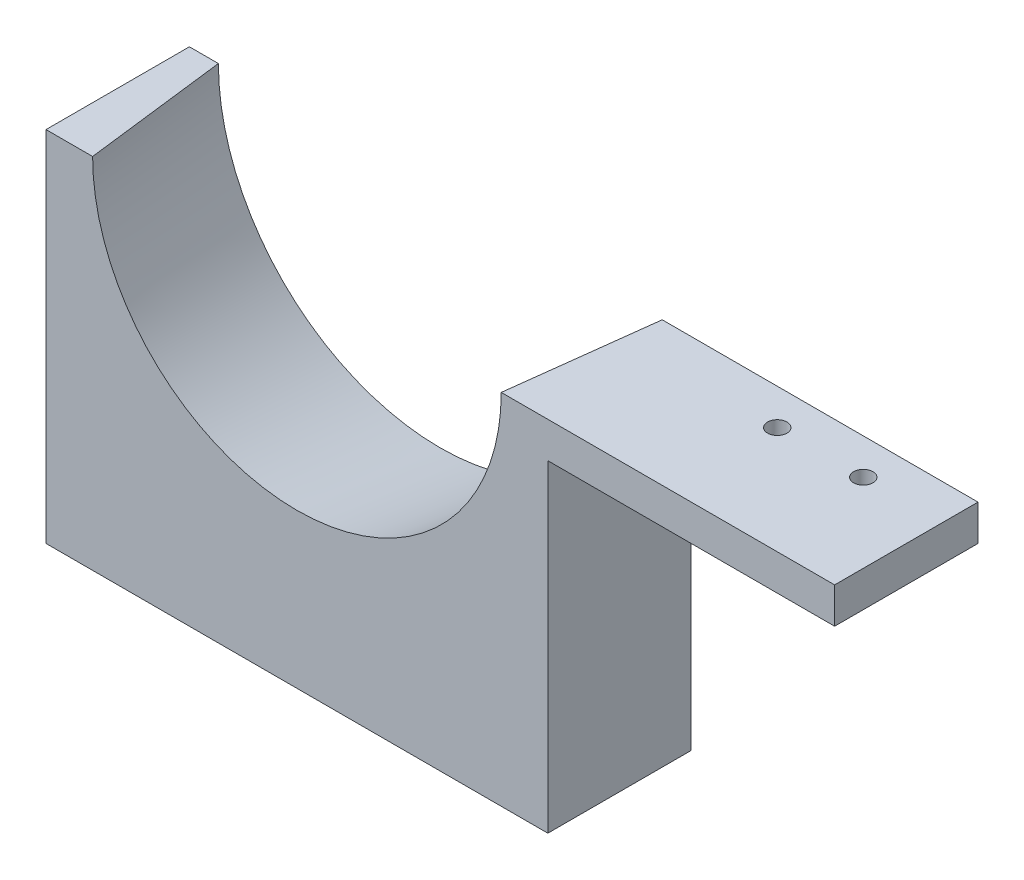
ISO-10303-21;
HEADER;
FILE_DESCRIPTION(('STEP AP214'),'2;1');
FILE_NAME('part.step','',(''),(''),'','','');
FILE_SCHEMA(('AUTOMOTIVE_DESIGN { 1 0 10303 214 1 1 1 1 }'));
ENDSEC;
DATA;
#1=APPLICATION_CONTEXT('core data for automotive mechanical design processes');
#2=APPLICATION_PROTOCOL_DEFINITION('international standard','automotive_design',2000,#1);
#3=PRODUCT_CONTEXT('',#1,'mechanical');
#4=PRODUCT('Part','Part','',(#3));
#5=PRODUCT_RELATED_PRODUCT_CATEGORY('part','',(#4));
#6=PRODUCT_DEFINITION_FORMATION('','',#4);
#7=PRODUCT_DEFINITION_CONTEXT('part definition',#1,'design');
#8=PRODUCT_DEFINITION('design','',#6,#7);
#9=PRODUCT_DEFINITION_SHAPE('','',#8);
#10=(LENGTH_UNIT() NAMED_UNIT(*) SI_UNIT(.MILLI.,.METRE.));
#11=(NAMED_UNIT(*) PLANE_ANGLE_UNIT() SI_UNIT($,.RADIAN.));
#12=(NAMED_UNIT(*) SI_UNIT($,.STERADIAN.) SOLID_ANGLE_UNIT());
#13=UNCERTAINTY_MEASURE_WITH_UNIT(LENGTH_MEASURE(1.E-05),#10,'distance_accuracy_value','');
#14=(GEOMETRIC_REPRESENTATION_CONTEXT(3) GLOBAL_UNCERTAINTY_ASSIGNED_CONTEXT((#13)) GLOBAL_UNIT_ASSIGNED_CONTEXT((#10,
#11,#12)) REPRESENTATION_CONTEXT('',''));
#15=CARTESIAN_POINT('',(0.,0.,0.));
#16=DIRECTION('',(0.,0.,1.));
#17=DIRECTION('',(1.,0.,0.));
#18=AXIS2_PLACEMENT_3D('',#15,#16,#17);
#19=CARTESIAN_POINT('',(0.,0.,20.));
#20=DIRECTION('',(0.,-1.,0.));
#21=DIRECTION('',(1.,0.,0.));
#22=AXIS2_PLACEMENT_3D('',#19,#20,#21);
#23=PLANE('',#22);
#24=DIRECTION('',(-1.,0.,0.));
#25=VECTOR('',#24,1.);
#26=CARTESIAN_POINT('',(0.,0.,20.));
#27=LINE('',#26,#25);
#28=CARTESIAN_POINT('',(-103.5,0.,20.));
#29=VERTEX_POINT('',#28);
#30=CARTESIAN_POINT('',(-110.,0.,20.));
#31=VERTEX_POINT('',#30);
#32=EDGE_CURVE('E96',#29,#31,#27,.T.);
#33=ORIENTED_EDGE('',*,*,#32,.F.);
#34=DIRECTION('',(-0.121869343405148,0.,-0.992546151641322));
#35=VECTOR('',#34,1.);
#36=CARTESIAN_POINT('',(-75.,0.,252.113873197276));
#37=LINE('',#36,#35);
#38=CARTESIAN_POINT('',(-105.955691218058,0.,0.));
#39=VERTEX_POINT('',#38);
#40=EDGE_CURVE('E166',#29,#39,#37,.T.);
#41=ORIENTED_EDGE('',*,*,#40,.T.);
#42=DIRECTION('',(-1.,0.,0.));
#43=VECTOR('',#42,1.);
#44=CARTESIAN_POINT('',(0.,0.,0.));
#45=LINE('',#44,#43);
#46=CARTESIAN_POINT('',(-110.,0.,0.));
#47=VERTEX_POINT('',#46);
#48=EDGE_CURVE('E138',#39,#47,#45,.T.);
#49=ORIENTED_EDGE('',*,*,#48,.T.);
#50=DIRECTION('',(0.,0.,-1.));
#51=VECTOR('',#50,1.);
#52=CARTESIAN_POINT('',(-110.,0.,20.));
#53=LINE('',#52,#51);
#54=EDGE_CURVE('E47',#31,#47,#53,.T.);
#55=ORIENTED_EDGE('',*,*,#54,.F.);
#56=EDGE_LOOP('',(#33,#41,#49,#55));
#57=FACE_BOUND('',#56,.T.);
#58=ADVANCED_FACE('F39',(#57),#23,.F.);
#59=CARTESIAN_POINT('',(-23.0000000000479,0.,4.99999999998709));
#60=DIRECTION('',(0.,-1.,0.));
#61=DIRECTION('',(1.,0.,0.));
#62=AXIS2_PLACEMENT_3D('',#59,#60,#61);
#63=CIRCLE('',#62,1.35000000000145);
#64=CARTESIAN_POINT('',(-21.6500000000464,0.,4.99999999998709));
#65=VERTEX_POINT('',#64);
#66=EDGE_CURVE('E181',#65,#65,#63,.T.);
#67=ORIENTED_EDGE('',*,*,#66,.T.);
#68=EDGE_LOOP('',(#67));
#69=FACE_BOUND('',#68,.T.);
#70=CARTESIAN_POINT('',(-11.0000000000479,0.,4.99999999999137));
#71=DIRECTION('',(0.,-1.,0.));
#72=DIRECTION('',(1.,0.,0.));
#73=AXIS2_PLACEMENT_3D('',#70,#71,#72);
#74=CIRCLE('',#73,1.35000000000145);
#75=CARTESIAN_POINT('',(-9.65000000004644,0.,4.99999999999137));
#76=VERTEX_POINT('',#75);
#77=EDGE_CURVE('E182',#76,#76,#74,.T.);
#78=ORIENTED_EDGE('',*,*,#77,.T.);
#79=EDGE_LOOP('',(#78));
#80=FACE_BOUND('',#79,.T.);
#81=CARTESIAN_POINT('',(0.,0.,0.));
#82=VERTEX_POINT('',#81);
#83=CARTESIAN_POINT('',(-44.0443087819419,0.,0.));
#84=VERTEX_POINT('',#83);
#85=EDGE_CURVE('E135',#82,#84,#45,.T.);
#86=ORIENTED_EDGE('',*,*,#85,.T.);
#87=DIRECTION('',(-0.121869343405148,0.,0.992546151641322));
#88=VECTOR('',#87,1.);
#89=CARTESIAN_POINT('',(-75.,0.,252.113873197276));
#90=LINE('',#89,#88);
#91=CARTESIAN_POINT('',(-46.5,0.,20.));
#92=VERTEX_POINT('',#91);
#93=EDGE_CURVE('E54',#84,#92,#90,.T.);
#94=ORIENTED_EDGE('',*,*,#93,.T.);
#95=CARTESIAN_POINT('',(0.,0.,20.));
#96=VERTEX_POINT('',#95);
#97=EDGE_CURVE('E172',#96,#92,#27,.T.);
#98=ORIENTED_EDGE('',*,*,#97,.F.);
#99=DIRECTION('',(0.,0.,-1.));
#100=VECTOR('',#99,1.);
#101=CARTESIAN_POINT('',(0.,0.,20.));
#102=LINE('',#101,#100);
#103=EDGE_CURVE('E62',#96,#82,#102,.T.);
#104=ORIENTED_EDGE('',*,*,#103,.T.);
#105=EDGE_LOOP('',(#86,#94,#98,#104));
#106=FACE_BOUND('',#105,.T.);
#107=ADVANCED_FACE('F41',(#69,#80,#106),#23,.F.);
#108=CARTESIAN_POINT('',(-110.,0.,20.));
#109=DIRECTION('',(1.,0.,0.));
#110=DIRECTION('',(0.,1.,0.));
#111=AXIS2_PLACEMENT_3D('',#108,#109,#110);
#112=PLANE('',#111);
#113=DIRECTION('',(0.,-1.,0.));
#114=VECTOR('',#113,1.);
#115=CARTESIAN_POINT('',(-110.,0.,0.));
#116=LINE('',#115,#114);
#117=CARTESIAN_POINT('',(-110.,-50.,0.));
#118=VERTEX_POINT('',#117);
#119=EDGE_CURVE('E137',#47,#118,#116,.T.);
#120=ORIENTED_EDGE('',*,*,#119,.T.);
#121=DIRECTION('',(0.,0.,-1.));
#122=VECTOR('',#121,1.);
#123=CARTESIAN_POINT('',(-110.,-50.,20.));
#124=LINE('',#123,#122);
#125=CARTESIAN_POINT('',(-110.,-50.,20.));
#126=VERTEX_POINT('',#125);
#127=EDGE_CURVE('E153',#126,#118,#124,.T.);
#128=ORIENTED_EDGE('',*,*,#127,.F.);
#129=DIRECTION('',(0.,-1.,0.));
#130=VECTOR('',#129,1.);
#131=CARTESIAN_POINT('',(-110.,0.,20.));
#132=LINE('',#131,#130);
#133=EDGE_CURVE('E160',#31,#126,#132,.T.);
#134=ORIENTED_EDGE('',*,*,#133,.F.);
#135=ORIENTED_EDGE('',*,*,#54,.T.);
#136=EDGE_LOOP('',(#120,#128,#134,#135));
#137=FACE_BOUND('',#136,.T.);
#138=ADVANCED_FACE('F157',(#137),#112,.F.);
#139=CARTESIAN_POINT('',(0.,-50.,20.));
#140=DIRECTION('',(0.,-1.,0.));
#141=DIRECTION('',(1.,0.,0.));
#142=AXIS2_PLACEMENT_3D('',#139,#140,#141);
#143=PLANE('',#142);
#144=DIRECTION('',(-1.,0.,0.));
#145=VECTOR('',#144,1.);
#146=CARTESIAN_POINT('',(0.,-50.,0.));
#147=LINE('',#146,#145);
#148=CARTESIAN_POINT('',(-40.,-50.,0.));
#149=VERTEX_POINT('',#148);
#150=EDGE_CURVE('E141',#149,#118,#147,.T.);
#151=ORIENTED_EDGE('',*,*,#150,.F.);
#152=DIRECTION('',(0.,0.,-1.));
#153=VECTOR('',#152,1.);
#154=CARTESIAN_POINT('',(-40.,-50.,20.));
#155=LINE('',#154,#153);
#156=CARTESIAN_POINT('',(-40.,-50.,20.));
#157=VERTEX_POINT('',#156);
#158=EDGE_CURVE('E118',#157,#149,#155,.T.);
#159=ORIENTED_EDGE('',*,*,#158,.F.);
#160=DIRECTION('',(-1.,0.,0.));
#161=VECTOR('',#160,1.);
#162=CARTESIAN_POINT('',(0.,-50.,20.));
#163=LINE('',#162,#161);
#164=EDGE_CURVE('E127',#157,#126,#163,.T.);
#165=ORIENTED_EDGE('',*,*,#164,.T.);
#166=ORIENTED_EDGE('',*,*,#127,.T.);
#167=EDGE_LOOP('',(#151,#159,#165,#166));
#168=FACE_BOUND('',#167,.T.);
#169=ADVANCED_FACE('F171',(#168),#143,.T.);
#170=CARTESIAN_POINT('',(-40.,0.,20.));
#171=DIRECTION('',(1.,0.,0.));
#172=DIRECTION('',(0.,1.,0.));
#173=AXIS2_PLACEMENT_3D('',#170,#171,#172);
#174=PLANE('',#173);
#175=DIRECTION('',(0.,-1.,0.));
#176=VECTOR('',#175,1.);
#177=CARTESIAN_POINT('',(-40.,0.,0.));
#178=LINE('',#177,#176);
#179=CARTESIAN_POINT('',(-40.,-5.00000000000001,0.));
#180=VERTEX_POINT('',#179);
#181=EDGE_CURVE('E113',#180,#149,#178,.T.);
#182=ORIENTED_EDGE('',*,*,#181,.F.);
#183=DIRECTION('',(0.,0.,-1.));
#184=VECTOR('',#183,1.);
#185=CARTESIAN_POINT('',(-40.,-5.00000000000001,20.));
#186=LINE('',#185,#184);
#187=CARTESIAN_POINT('',(-40.,-5.00000000000001,20.));
#188=VERTEX_POINT('',#187);
#189=EDGE_CURVE('E108',#188,#180,#186,.T.);
#190=ORIENTED_EDGE('',*,*,#189,.F.);
#191=DIRECTION('',(0.,-1.,0.));
#192=VECTOR('',#191,1.);
#193=CARTESIAN_POINT('',(-40.,0.,20.));
#194=LINE('',#193,#192);
#195=EDGE_CURVE('E111',#188,#157,#194,.T.);
#196=ORIENTED_EDGE('',*,*,#195,.T.);
#197=ORIENTED_EDGE('',*,*,#158,.T.);
#198=EDGE_LOOP('',(#182,#190,#196,#197));
#199=FACE_BOUND('',#198,.T.);
#200=ADVANCED_FACE('F110',(#199),#174,.T.);
#201=CARTESIAN_POINT('',(0.,-5.,20.));
#202=DIRECTION('',(0.,-1.,0.));
#203=DIRECTION('',(1.,0.,0.));
#204=AXIS2_PLACEMENT_3D('',#201,#202,#203);
#205=PLANE('',#204);
#206=CARTESIAN_POINT('',(-23.0000000000479,-5.,4.99999999998709));
#207=DIRECTION('',(0.,-1.,0.));
#208=DIRECTION('',(1.,0.,0.));
#209=AXIS2_PLACEMENT_3D('',#206,#207,#208);
#210=CIRCLE('',#209,1.35000000000145);
#211=CARTESIAN_POINT('',(-21.6500000000464,-5.,4.99999999998709));
#212=VERTEX_POINT('',#211);
#213=EDGE_CURVE('E188',#212,#212,#210,.T.);
#214=ORIENTED_EDGE('',*,*,#213,.F.);
#215=EDGE_LOOP('',(#214));
#216=FACE_BOUND('',#215,.T.);
#217=CARTESIAN_POINT('',(-11.0000000000479,-5.,4.99999999999137));
#218=DIRECTION('',(0.,-1.,0.));
#219=DIRECTION('',(1.,0.,0.));
#220=AXIS2_PLACEMENT_3D('',#217,#218,#219);
#221=CIRCLE('',#220,1.35000000000145);
#222=CARTESIAN_POINT('',(-9.65000000004644,-5.,4.99999999999137));
#223=VERTEX_POINT('',#222);
#224=EDGE_CURVE('E185',#223,#223,#221,.T.);
#225=ORIENTED_EDGE('',*,*,#224,.F.);
#226=EDGE_LOOP('',(#225));
#227=FACE_BOUND('',#226,.T.);
#228=DIRECTION('',(-1.,0.,0.));
#229=VECTOR('',#228,1.);
#230=CARTESIAN_POINT('',(0.,-5.,0.));
#231=LINE('',#230,#229);
#232=CARTESIAN_POINT('',(0.,-5.,0.));
#233=VERTEX_POINT('',#232);
#234=EDGE_CURVE('E145',#233,#180,#231,.T.);
#235=ORIENTED_EDGE('',*,*,#234,.F.);
#236=DIRECTION('',(0.,0.,-1.));
#237=VECTOR('',#236,1.);
#238=CARTESIAN_POINT('',(0.,-5.,20.));
#239=LINE('',#238,#237);
#240=CARTESIAN_POINT('',(0.,-5.,20.));
#241=VERTEX_POINT('',#240);
#242=EDGE_CURVE('E119',#241,#233,#239,.T.);
#243=ORIENTED_EDGE('',*,*,#242,.F.);
#244=DIRECTION('',(-1.,0.,0.));
#245=VECTOR('',#244,1.);
#246=CARTESIAN_POINT('',(0.,-5.,20.));
#247=LINE('',#246,#245);
#248=EDGE_CURVE('E125',#241,#188,#247,.T.);
#249=ORIENTED_EDGE('',*,*,#248,.T.);
#250=ORIENTED_EDGE('',*,*,#189,.T.);
#251=EDGE_LOOP('',(#235,#243,#249,#250));
#252=FACE_BOUND('',#251,.T.);
#253=ADVANCED_FACE('F129',(#216,#227,#252),#205,.T.);
#254=CARTESIAN_POINT('',(0.,0.,20.));
#255=DIRECTION('',(1.,0.,0.));
#256=DIRECTION('',(0.,1.,0.));
#257=AXIS2_PLACEMENT_3D('',#254,#255,#256);
#258=PLANE('',#257);
#259=DIRECTION('',(0.,-1.,0.));
#260=VECTOR('',#259,1.);
#261=CARTESIAN_POINT('',(0.,0.,0.));
#262=LINE('',#261,#260);
#263=EDGE_CURVE('E147',#82,#233,#262,.T.);
#264=ORIENTED_EDGE('',*,*,#263,.F.);
#265=ORIENTED_EDGE('',*,*,#103,.F.);
#266=DIRECTION('',(0.,-1.,0.));
#267=VECTOR('',#266,1.);
#268=CARTESIAN_POINT('',(0.,0.,20.));
#269=LINE('',#268,#267);
#270=EDGE_CURVE('E130',#96,#241,#269,.T.);
#271=ORIENTED_EDGE('',*,*,#270,.T.);
#272=ORIENTED_EDGE('',*,*,#242,.T.);
#273=EDGE_LOOP('',(#264,#265,#271,#272));
#274=FACE_BOUND('',#273,.T.);
#275=ADVANCED_FACE('F205',(#274),#258,.T.);
#276=CARTESIAN_POINT('',(0.,0.,20.));
#277=DIRECTION('',(0.,0.,1.));
#278=DIRECTION('',(1.,0.,0.));
#279=AXIS2_PLACEMENT_3D('',#276,#277,#278);
#280=PLANE('',#279);
#281=CARTESIAN_POINT('',(-75.,0.,20.));
#282=DIRECTION('',(0.,0.,1.));
#283=DIRECTION('',(1.,0.,0.));
#284=AXIS2_PLACEMENT_3D('',#281,#282,#283);
#285=CIRCLE('',#284,28.5);
#286=EDGE_CURVE('E179',#29,#92,#285,.T.);
#287=ORIENTED_EDGE('',*,*,#286,.F.);
#288=ORIENTED_EDGE('',*,*,#32,.T.);
#289=ORIENTED_EDGE('',*,*,#133,.T.);
#290=ORIENTED_EDGE('',*,*,#164,.F.);
#291=ORIENTED_EDGE('',*,*,#195,.F.);
#292=ORIENTED_EDGE('',*,*,#248,.F.);
#293=ORIENTED_EDGE('',*,*,#270,.F.);
#294=ORIENTED_EDGE('',*,*,#97,.T.);
#295=EDGE_LOOP('',(#287,#288,#289,#290,#291,#292,#293,#294));
#296=FACE_BOUND('',#295,.T.);
#297=ADVANCED_FACE('F123',(#296),#280,.T.);
#298=CARTESIAN_POINT('',(0.,0.,0.));
#299=DIRECTION('',(0.,0.,1.));
#300=DIRECTION('',(1.,0.,0.));
#301=AXIS2_PLACEMENT_3D('',#298,#299,#300);
#302=PLANE('',#301);
#303=ORIENTED_EDGE('',*,*,#48,.F.);
#304=CARTESIAN_POINT('',(-75.,0.,0.));
#305=DIRECTION('',(0.,0.,1.));
#306=DIRECTION('',(1.,0.,0.));
#307=AXIS2_PLACEMENT_3D('',#304,#305,#306);
#308=CIRCLE('',#307,30.9556912180581);
#309=EDGE_CURVE('E11',#39,#84,#308,.T.);
#310=ORIENTED_EDGE('',*,*,#309,.T.);
#311=ORIENTED_EDGE('',*,*,#85,.F.);
#312=ORIENTED_EDGE('',*,*,#263,.T.);
#313=ORIENTED_EDGE('',*,*,#234,.T.);
#314=ORIENTED_EDGE('',*,*,#181,.T.);
#315=ORIENTED_EDGE('',*,*,#150,.T.);
#316=ORIENTED_EDGE('',*,*,#119,.F.);
#317=EDGE_LOOP('',(#303,#310,#311,#312,#313,#314,#315,#316));
#318=FACE_BOUND('',#317,.T.);
#319=ADVANCED_FACE('F168',(#318),#302,.F.);
#320=CARTESIAN_POINT('',(-75.,0.,20.));
#321=DIRECTION('',(0.,0.,-1.));
#322=DIRECTION('',(1.,0.,0.));
#323=AXIS2_PLACEMENT_3D('',#320,#321,#322);
#324=CONICAL_SURFACE('',#323,28.5,0.122173047639603);
#325=ORIENTED_EDGE('',*,*,#286,.T.);
#326=ORIENTED_EDGE('',*,*,#93,.F.);
#327=ORIENTED_EDGE('',*,*,#309,.F.);
#328=ORIENTED_EDGE('',*,*,#40,.F.);
#329=EDGE_LOOP('',(#325,#326,#327,#328));
#330=FACE_BOUND('',#329,.T.);
#331=ADVANCED_FACE('F210',(#330),#324,.F.);
#332=CARTESIAN_POINT('',(-11.0000000000479,0.,4.99999999999137));
#333=DIRECTION('',(0.,-1.,0.));
#334=DIRECTION('',(1.,0.,0.));
#335=AXIS2_PLACEMENT_3D('',#332,#333,#334);
#336=CYLINDRICAL_SURFACE('',#335,1.35000000000145);
#337=ORIENTED_EDGE('',*,*,#77,.F.);
#338=EDGE_LOOP('',(#337));
#339=FACE_BOUND('',#338,.T.);
#340=ORIENTED_EDGE('',*,*,#224,.T.);
#341=EDGE_LOOP('',(#340));
#342=FACE_BOUND('',#341,.T.);
#343=ADVANCED_FACE('F199',(#339,#342),#336,.F.);
#344=CARTESIAN_POINT('',(-23.0000000000479,0.,4.99999999998709));
#345=DIRECTION('',(0.,-1.,0.));
#346=DIRECTION('',(1.,0.,0.));
#347=AXIS2_PLACEMENT_3D('',#344,#345,#346);
#348=CYLINDRICAL_SURFACE('',#347,1.35000000000145);
#349=ORIENTED_EDGE('',*,*,#66,.F.);
#350=EDGE_LOOP('',(#349));
#351=FACE_BOUND('',#350,.T.);
#352=ORIENTED_EDGE('',*,*,#213,.T.);
#353=EDGE_LOOP('',(#352));
#354=FACE_BOUND('',#353,.T.);
#355=ADVANCED_FACE('F196',(#351,#354),#348,.F.);
#356=CLOSED_SHELL('',(#58,#107,#138,#169,#200,#253,#275,#297,#319,#331,#343,#355));
#357=MANIFOLD_SOLID_BREP('B2',#356);
#358=ADVANCED_BREP_SHAPE_REPRESENTATION('',(#18,#357),#14);
#359=SHAPE_DEFINITION_REPRESENTATION(#9,#358);
ENDSEC;
END-ISO-10303-21;
